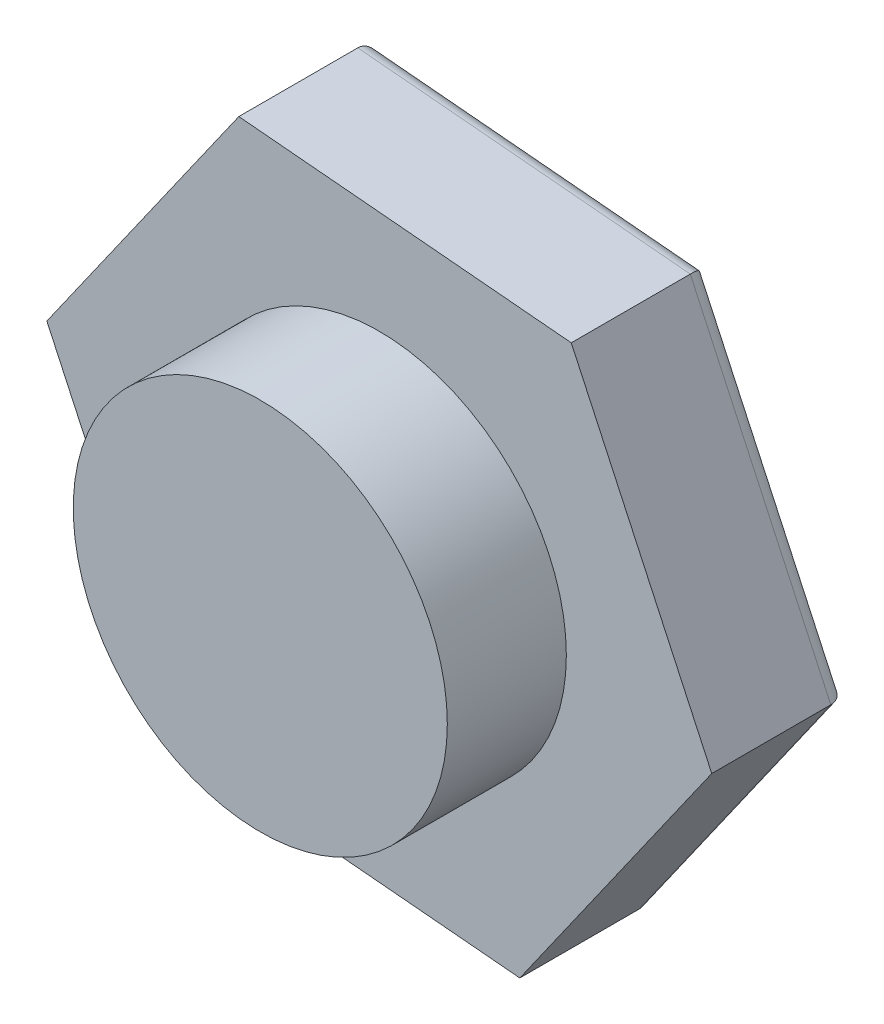
ISO-10303-21;
HEADER;
FILE_DESCRIPTION(('STEP AP214'),'2;1');
FILE_NAME('part.step','',(''),(''),'','','');
FILE_SCHEMA(('AUTOMOTIVE_DESIGN { 1 0 10303 214 1 1 1 1 }'));
ENDSEC;
DATA;
#1=APPLICATION_CONTEXT('core data for automotive mechanical design processes');
#2=APPLICATION_PROTOCOL_DEFINITION('international standard','automotive_design',2000,#1);
#3=PRODUCT_CONTEXT('',#1,'mechanical');
#4=PRODUCT('Part','Part','',(#3));
#5=PRODUCT_RELATED_PRODUCT_CATEGORY('part','',(#4));
#6=PRODUCT_DEFINITION_FORMATION('','',#4);
#7=PRODUCT_DEFINITION_CONTEXT('part definition',#1,'design');
#8=PRODUCT_DEFINITION('design','',#6,#7);
#9=PRODUCT_DEFINITION_SHAPE('','',#8);
#10=(LENGTH_UNIT() NAMED_UNIT(*) SI_UNIT(.MILLI.,.METRE.));
#11=(NAMED_UNIT(*) PLANE_ANGLE_UNIT() SI_UNIT($,.RADIAN.));
#12=(NAMED_UNIT(*) SI_UNIT($,.STERADIAN.) SOLID_ANGLE_UNIT());
#13=UNCERTAINTY_MEASURE_WITH_UNIT(LENGTH_MEASURE(1.E-05),#10,'distance_accuracy_value','');
#14=(GEOMETRIC_REPRESENTATION_CONTEXT(3) GLOBAL_UNCERTAINTY_ASSIGNED_CONTEXT((#13)) GLOBAL_UNIT_ASSIGNED_CONTEXT((#10,
#11,#12)) REPRESENTATION_CONTEXT('',''));
#15=CARTESIAN_POINT('',(0.,0.,0.));
#16=DIRECTION('',(0.,0.,1.));
#17=DIRECTION('',(1.,0.,0.));
#18=AXIS2_PLACEMENT_3D('',#15,#16,#17);
#19=CARTESIAN_POINT('',(0.,0.,7.));
#20=DIRECTION('',(0.,0.,-1.));
#21=DIRECTION('',(-1.,0.,0.));
#22=AXIS2_PLACEMENT_3D('',#19,#20,#21);
#23=CYLINDRICAL_SURFACE('',#22,11.);
#24=CARTESIAN_POINT('',(0.,0.,7.));
#25=DIRECTION('',(0.,0.,1.));
#26=DIRECTION('',(1.,0.,0.));
#27=AXIS2_PLACEMENT_3D('',#24,#25,#26);
#28=CIRCLE('',#27,11.);
#29=CARTESIAN_POINT('',(11.,0.,7.));
#30=VERTEX_POINT('',#29);
#31=EDGE_CURVE('E153',#30,#30,#28,.T.);
#32=ORIENTED_EDGE('',*,*,#31,.F.);
#33=EDGE_LOOP('',(#32));
#34=FACE_BOUND('',#33,.T.);
#35=CARTESIAN_POINT('',(0.,0.,0.));
#36=DIRECTION('',(0.,0.,1.));
#37=DIRECTION('',(1.,0.,0.));
#38=AXIS2_PLACEMENT_3D('',#35,#36,#37);
#39=CIRCLE('',#38,11.);
#40=CARTESIAN_POINT('',(11.,0.,0.));
#41=VERTEX_POINT('',#40);
#42=EDGE_CURVE('E116',#41,#41,#39,.T.);
#43=ORIENTED_EDGE('',*,*,#42,.T.);
#44=EDGE_LOOP('',(#43));
#45=FACE_BOUND('',#44,.T.);
#46=ADVANCED_FACE('F38',(#34,#45),#23,.T.);
#47=CARTESIAN_POINT('',(0.,0.,7.));
#48=DIRECTION('',(0.,0.,1.));
#49=DIRECTION('',(1.,0.,0.));
#50=AXIS2_PLACEMENT_3D('',#47,#48,#49);
#51=PLANE('',#50);
#52=ORIENTED_EDGE('',*,*,#31,.T.);
#53=EDGE_LOOP('',(#52));
#54=FACE_BOUND('',#53,.T.);
#55=ADVANCED_FACE('F234',(#54),#51,.T.);
#56=CARTESIAN_POINT('',(11.2892059741535,16.0588655205301,-8.));
#57=DIRECTION('',(-0.907093954646099,-0.420928209371267,0.));
#58=DIRECTION('',(0.420928209371267,-0.907093954646099,0.));
#59=AXIS2_PLACEMENT_3D('',#56,#57,#58);
#60=PLANE('',#59);
#61=DIRECTION('',(0.,0.,1.));
#62=VECTOR('',#61,1.);
#63=CARTESIAN_POINT('',(19.5519884838138,-1.74730640190698,-8.));
#64=LINE('',#63,#62);
#65=CARTESIAN_POINT('',(19.5519884838138,-1.74730640190698,-7.));
#66=VERTEX_POINT('',#65);
#67=CARTESIAN_POINT('',(19.5519884838138,-1.74730640190698,0.));
#68=VERTEX_POINT('',#67);
#69=EDGE_CURVE('E108',#66,#68,#64,.T.);
#70=ORIENTED_EDGE('',*,*,#69,.F.);
#71=DIRECTION('',(0.420928209371267,-0.907093954646099,0.));
#72=VECTOR('',#71,1.);
#73=CARTESIAN_POINT('',(11.2892059741535,16.0588655205301,-7.));
#74=LINE('',#73,#72);
#75=CARTESIAN_POINT('',(11.2892059741535,16.0588655205301,-7.));
#76=VERTEX_POINT('',#75);
#77=EDGE_CURVE('E11',#66,#76,#74,.F.);
#78=ORIENTED_EDGE('',*,*,#77,.T.);
#79=DIRECTION('',(0.,0.,1.));
#80=VECTOR('',#79,1.);
#81=CARTESIAN_POINT('',(11.2892059741535,16.0588655205301,-8.));
#82=LINE('',#81,#80);
#83=CARTESIAN_POINT('',(11.2892059741535,16.0588655205301,0.));
#84=VERTEX_POINT('',#83);
#85=EDGE_CURVE('E130',#76,#84,#82,.T.);
#86=ORIENTED_EDGE('',*,*,#85,.T.);
#87=DIRECTION('',(0.420928209371267,-0.907093954646099,0.));
#88=VECTOR('',#87,1.);
#89=CARTESIAN_POINT('',(11.2892059741535,16.0588655205301,0.));
#90=LINE('',#89,#88);
#91=EDGE_CURVE('E123',#84,#68,#90,.T.);
#92=ORIENTED_EDGE('',*,*,#91,.T.);
#93=EDGE_LOOP('',(#70,#78,#86,#92));
#94=FACE_BOUND('',#93,.T.);
#95=ADVANCED_FACE('F128',(#94),#60,.F.);
#96=CARTESIAN_POINT('',(19.5519884838138,-1.74730640190698,-8.));
#97=DIRECTION('',(-0.818081499808062,0.575102303657177,0.));
#98=DIRECTION('',(-0.575102303657177,-0.818081499808062,0.));
#99=AXIS2_PLACEMENT_3D('',#96,#97,#98);
#100=PLANE('',#99);
#101=DIRECTION('',(0.,0.,1.));
#102=VECTOR('',#101,1.);
#103=CARTESIAN_POINT('',(8.26278250966028,-17.8061719224371,-8.));
#104=LINE('',#103,#102);
#105=CARTESIAN_POINT('',(8.26278250966028,-17.8061719224371,-7.));
#106=VERTEX_POINT('',#105);
#107=CARTESIAN_POINT('',(8.26278250966028,-17.8061719224371,0.));
#108=VERTEX_POINT('',#107);
#109=EDGE_CURVE('E117',#106,#108,#104,.T.);
#110=ORIENTED_EDGE('',*,*,#109,.F.);
#111=DIRECTION('',(-0.575102303657177,-0.818081499808062,0.));
#112=VECTOR('',#111,1.);
#113=CARTESIAN_POINT('',(19.5519884838138,-1.74730640190698,-7.));
#114=LINE('',#113,#112);
#115=EDGE_CURVE('E47',#106,#66,#114,.F.);
#116=ORIENTED_EDGE('',*,*,#115,.T.);
#117=ORIENTED_EDGE('',*,*,#69,.T.);
#118=DIRECTION('',(-0.575102303657177,-0.818081499808062,0.));
#119=VECTOR('',#118,1.);
#120=CARTESIAN_POINT('',(19.5519884838138,-1.74730640190698,0.));
#121=LINE('',#120,#119);
#122=EDGE_CURVE('E111',#68,#108,#121,.T.);
#123=ORIENTED_EDGE('',*,*,#122,.T.);
#124=EDGE_LOOP('',(#110,#116,#117,#123));
#125=FACE_BOUND('',#124,.T.);
#126=ADVANCED_FACE('F110',(#125),#100,.F.);
#127=CARTESIAN_POINT('',(8.26278250966028,-17.8061719224371,-8.));
#128=DIRECTION('',(0.0890124548380372,0.996030513028445,0.));
#129=DIRECTION('',(-0.996030513028445,0.0890124548380372,0.));
#130=AXIS2_PLACEMENT_3D('',#127,#128,#129);
#131=PLANE('',#130);
#132=DIRECTION('',(0.,0.,1.));
#133=VECTOR('',#132,1.);
#134=CARTESIAN_POINT('',(-11.2892059741535,-16.0588655205301,-8.));
#135=LINE('',#134,#133);
#136=CARTESIAN_POINT('',(-11.2892059741535,-16.0588655205301,-7.));
#137=VERTEX_POINT('',#136);
#138=CARTESIAN_POINT('',(-11.2892059741535,-16.0588655205301,0.));
#139=VERTEX_POINT('',#138);
#140=EDGE_CURVE('E150',#137,#139,#135,.T.);
#141=ORIENTED_EDGE('',*,*,#140,.F.);
#142=DIRECTION('',(-0.996030513028445,0.0890124548380372,0.));
#143=VECTOR('',#142,1.);
#144=CARTESIAN_POINT('',(8.26278250966028,-17.8061719224371,-7.));
#145=LINE('',#144,#143);
#146=EDGE_CURVE('E62',#137,#106,#145,.F.);
#147=ORIENTED_EDGE('',*,*,#146,.T.);
#148=ORIENTED_EDGE('',*,*,#109,.T.);
#149=DIRECTION('',(-0.996030513028445,0.0890124548380372,0.));
#150=VECTOR('',#149,1.);
#151=CARTESIAN_POINT('',(8.26278250966028,-17.8061719224371,0.));
#152=LINE('',#151,#150);
#153=EDGE_CURVE('E126',#108,#139,#152,.T.);
#154=ORIENTED_EDGE('',*,*,#153,.T.);
#155=EDGE_LOOP('',(#141,#147,#148,#154));
#156=FACE_BOUND('',#155,.T.);
#157=ADVANCED_FACE('F321',(#156),#131,.F.);
#158=CARTESIAN_POINT('',(-11.2892059741535,-16.0588655205301,-8.));
#159=DIRECTION('',(0.907093954646099,0.420928209371267,0.));
#160=DIRECTION('',(-0.420928209371267,0.907093954646099,0.));
#161=AXIS2_PLACEMENT_3D('',#158,#159,#160);
#162=PLANE('',#161);
#163=DIRECTION('',(0.,0.,1.));
#164=VECTOR('',#163,1.);
#165=CARTESIAN_POINT('',(-19.5519884838138,1.74730640190698,-8.));
#166=LINE('',#165,#164);
#167=CARTESIAN_POINT('',(-19.5519884838138,1.74730640190698,-7.));
#168=VERTEX_POINT('',#167);
#169=CARTESIAN_POINT('',(-19.5519884838138,1.74730640190698,0.));
#170=VERTEX_POINT('',#169);
#171=EDGE_CURVE('E148',#168,#170,#166,.T.);
#172=ORIENTED_EDGE('',*,*,#171,.F.);
#173=DIRECTION('',(-0.420928209371267,0.907093954646099,0.));
#174=VECTOR('',#173,1.);
#175=CARTESIAN_POINT('',(-11.2892059741535,-16.0588655205301,-7.));
#176=LINE('',#175,#174);
#177=EDGE_CURVE('E176',#168,#137,#176,.F.);
#178=ORIENTED_EDGE('',*,*,#177,.T.);
#179=ORIENTED_EDGE('',*,*,#140,.T.);
#180=DIRECTION('',(-0.420928209371267,0.907093954646099,0.));
#181=VECTOR('',#180,1.);
#182=CARTESIAN_POINT('',(-11.2892059741535,-16.0588655205301,0.));
#183=LINE('',#182,#181);
#184=EDGE_CURVE('E137',#139,#170,#183,.T.);
#185=ORIENTED_EDGE('',*,*,#184,.T.);
#186=EDGE_LOOP('',(#172,#178,#179,#185));
#187=FACE_BOUND('',#186,.T.);
#188=ADVANCED_FACE('F223',(#187),#162,.F.);
#189=CARTESIAN_POINT('',(-19.5519884838138,1.74730640190698,-8.));
#190=DIRECTION('',(0.818081499808062,-0.575102303657177,0.));
#191=DIRECTION('',(0.575102303657177,0.818081499808062,0.));
#192=AXIS2_PLACEMENT_3D('',#189,#190,#191);
#193=PLANE('',#192);
#194=DIRECTION('',(0.,0.,1.));
#195=VECTOR('',#194,1.);
#196=CARTESIAN_POINT('',(-8.26278250966028,17.8061719224371,-8.));
#197=LINE('',#196,#195);
#198=CARTESIAN_POINT('',(-8.26278250966028,17.8061719224371,-7.));
#199=VERTEX_POINT('',#198);
#200=CARTESIAN_POINT('',(-8.26278250966028,17.8061719224371,0.));
#201=VERTEX_POINT('',#200);
#202=EDGE_CURVE('E146',#199,#201,#197,.T.);
#203=ORIENTED_EDGE('',*,*,#202,.F.);
#204=DIRECTION('',(0.575102303657177,0.818081499808062,0.));
#205=VECTOR('',#204,1.);
#206=CARTESIAN_POINT('',(-19.5519884838138,1.74730640190698,-7.));
#207=LINE('',#206,#205);
#208=EDGE_CURVE('E174',#199,#168,#207,.F.);
#209=ORIENTED_EDGE('',*,*,#208,.T.);
#210=ORIENTED_EDGE('',*,*,#171,.T.);
#211=DIRECTION('',(0.575102303657177,0.818081499808062,0.));
#212=VECTOR('',#211,1.);
#213=CARTESIAN_POINT('',(-19.5519884838138,1.74730640190698,0.));
#214=LINE('',#213,#212);
#215=EDGE_CURVE('E140',#170,#201,#214,.T.);
#216=ORIENTED_EDGE('',*,*,#215,.T.);
#217=EDGE_LOOP('',(#203,#209,#210,#216));
#218=FACE_BOUND('',#217,.T.);
#219=ADVANCED_FACE('F220',(#218),#193,.F.);
#220=CARTESIAN_POINT('',(-8.26278250966028,17.8061719224371,-8.));
#221=DIRECTION('',(-0.0890124548380371,-0.996030513028445,0.));
#222=DIRECTION('',(0.996030513028445,-0.0890124548380371,0.));
#223=AXIS2_PLACEMENT_3D('',#220,#221,#222);
#224=PLANE('',#223);
#225=ORIENTED_EDGE('',*,*,#85,.F.);
#226=DIRECTION('',(0.996030513028445,-0.0890124548380371,0.));
#227=VECTOR('',#226,1.);
#228=CARTESIAN_POINT('',(-8.26278250966028,17.8061719224371,-7.));
#229=LINE('',#228,#227);
#230=EDGE_CURVE('E171',#76,#199,#229,.F.);
#231=ORIENTED_EDGE('',*,*,#230,.T.);
#232=ORIENTED_EDGE('',*,*,#202,.T.);
#233=DIRECTION('',(0.996030513028445,-0.0890124548380371,0.));
#234=VECTOR('',#233,1.);
#235=CARTESIAN_POINT('',(-8.26278250966028,17.8061719224371,0.));
#236=LINE('',#235,#234);
#237=EDGE_CURVE('E143',#201,#84,#236,.T.);
#238=ORIENTED_EDGE('',*,*,#237,.T.);
#239=EDGE_LOOP('',(#225,#231,#232,#238));
#240=FACE_BOUND('',#239,.T.);
#241=ADVANCED_FACE('F209',(#240),#224,.F.);
#242=CARTESIAN_POINT('',(0.,0.,-8.));
#243=DIRECTION('',(0.,0.,-1.));
#244=DIRECTION('',(-1.,0.,0.));
#245=AXIS2_PLACEMENT_3D('',#242,#243,#244);
#246=PLANE('',#245);
#247=DIRECTION('',(0.575102303657177,0.818081499808062,0.));
#248=VECTOR('',#247,1.);
#249=CARTESIAN_POINT('',(-7.44470100985222,17.2310696187799,-8.));
#250=LINE('',#249,#248);
#251=CARTESIAN_POINT('',(-18.4018715141777,1.64452367238304,-8.));
#252=VERTEX_POINT('',#251);
#253=CARTESIAN_POINT('',(-7.77673647968026,16.7587500446466,-8.));
#254=VERTEX_POINT('',#253);
#255=EDGE_CURVE('E166',#252,#254,#250,.T.);
#256=ORIENTED_EDGE('',*,*,#255,.T.);
#257=DIRECTION('',(0.996030513028445,-0.0890124548380371,0.));
#258=VECTOR('',#257,1.);
#259=CARTESIAN_POINT('',(11.2001935193155,15.0628350075016,-8.));
#260=LINE('',#259,#258);
#261=CARTESIAN_POINT('',(10.6251350344974,15.1142263722636,-8.));
#262=VERTEX_POINT('',#261);
#263=EDGE_CURVE('E168',#254,#262,#260,.T.);
#264=ORIENTED_EDGE('',*,*,#263,.T.);
#265=DIRECTION('',(0.420928209371267,-0.907093954646099,0.));
#266=VECTOR('',#265,1.);
#267=CARTESIAN_POINT('',(18.6448945291677,-2.16823461127825,-8.));
#268=LINE('',#267,#266);
#269=CARTESIAN_POINT('',(18.4018715141777,-1.64452367238304,-8.));
#270=VERTEX_POINT('',#269);
#271=EDGE_CURVE('E156',#262,#270,#268,.T.);
#272=ORIENTED_EDGE('',*,*,#271,.T.);
#273=DIRECTION('',(-0.575102303657177,-0.818081499808062,0.));
#274=VECTOR('',#273,1.);
#275=CARTESIAN_POINT('',(7.44470100985222,-17.2310696187799,-8.));
#276=LINE('',#275,#274);
#277=CARTESIAN_POINT('',(7.77673647968026,-16.7587500446466,-8.));
#278=VERTEX_POINT('',#277);
#279=EDGE_CURVE('E160',#270,#278,#276,.T.);
#280=ORIENTED_EDGE('',*,*,#279,.T.);
#281=DIRECTION('',(-0.996030513028445,0.0890124548380372,0.));
#282=VECTOR('',#281,1.);
#283=CARTESIAN_POINT('',(-11.2001935193155,-15.0628350075016,-8.));
#284=LINE('',#283,#282);
#285=CARTESIAN_POINT('',(-10.6251350344975,-15.1142263722636,-8.));
#286=VERTEX_POINT('',#285);
#287=EDGE_CURVE('E162',#278,#286,#284,.T.);
#288=ORIENTED_EDGE('',*,*,#287,.T.);
#289=DIRECTION('',(-0.420928209371267,0.907093954646099,0.));
#290=VECTOR('',#289,1.);
#291=CARTESIAN_POINT('',(-18.6448945291677,2.16823461127825,-8.));
#292=LINE('',#291,#290);
#293=EDGE_CURVE('E164',#286,#252,#292,.T.);
#294=ORIENTED_EDGE('',*,*,#293,.T.);
#295=EDGE_LOOP('',(#256,#264,#272,#280,#288,#294));
#296=FACE_BOUND('',#295,.T.);
#297=ADVANCED_FACE('F199',(#296),#246,.T.);
#298=CARTESIAN_POINT('',(0.,0.,0.));
#299=DIRECTION('',(0.,0.,-1.));
#300=DIRECTION('',(-1.,0.,0.));
#301=AXIS2_PLACEMENT_3D('',#298,#299,#300);
#302=PLANE('',#301);
#303=ORIENTED_EDGE('',*,*,#42,.F.);
#304=EDGE_LOOP('',(#303));
#305=FACE_BOUND('',#304,.T.);
#306=ORIENTED_EDGE('',*,*,#91,.F.);
#307=ORIENTED_EDGE('',*,*,#237,.F.);
#308=ORIENTED_EDGE('',*,*,#215,.F.);
#309=ORIENTED_EDGE('',*,*,#184,.F.);
#310=ORIENTED_EDGE('',*,*,#153,.F.);
#311=ORIENTED_EDGE('',*,*,#122,.F.);
#312=EDGE_LOOP('',(#306,#307,#308,#309,#310,#311));
#313=FACE_BOUND('',#312,.T.);
#314=ADVANCED_FACE('F121',(#305,#313),#302,.F.);
#315=CARTESIAN_POINT('',(-1.4241992774086,-15.9364882084551,-7.));
#316=DIRECTION('',(0.996030513028445,-0.0890124548380372,0.));
#317=DIRECTION('',(0.0890124548380372,0.996030513028445,0.));
#318=AXIS2_PLACEMENT_3D('',#315,#316,#317);
#319=CYLINDRICAL_SURFACE('',#318,1.);
#320=CARTESIAN_POINT('',(7.77673647968026,-16.7587500446466,-7.));
#321=DIRECTION('',(0.907093954646099,0.420928209371267,0.));
#322=DIRECTION('',(-0.420928209371267,0.907093954646099,0.));
#323=AXIS2_PLACEMENT_3D('',#320,#321,#322);
#324=ELLIPSE('',#323,1.15470053837925,1.);
#325=EDGE_CURVE('E134',#106,#278,#324,.T.);
#326=ORIENTED_EDGE('',*,*,#325,.F.);
#327=ORIENTED_EDGE('',*,*,#146,.F.);
#328=CARTESIAN_POINT('',(-10.6251350344975,-15.1142263722636,-7.));
#329=DIRECTION('',(0.818081499808062,-0.575102303657178,0.));
#330=DIRECTION('',(0.575102303657178,0.818081499808062,0.));
#331=AXIS2_PLACEMENT_3D('',#328,#329,#330);
#332=ELLIPSE('',#331,1.15470053837925,1.);
#333=EDGE_CURVE('E42',#286,#137,#332,.F.);
#334=ORIENTED_EDGE('',*,*,#333,.F.);
#335=ORIENTED_EDGE('',*,*,#287,.F.);
#336=EDGE_LOOP('',(#326,#327,#334,#335));
#337=FACE_BOUND('',#336,.T.);
#338=ADVANCED_FACE('F40',(#337),#319,.T.);
#339=CARTESIAN_POINT('',(-14.5135032743376,-6.73485134994027,-7.));
#340=DIRECTION('',(0.420928209371267,-0.907093954646099,0.));
#341=DIRECTION('',(0.907093954646099,0.420928209371267,0.));
#342=AXIS2_PLACEMENT_3D('',#339,#340,#341);
#343=CYLINDRICAL_SURFACE('',#342,1.);
#344=ORIENTED_EDGE('',*,*,#333,.T.);
#345=ORIENTED_EDGE('',*,*,#177,.F.);
#346=CARTESIAN_POINT('',(-18.4018715141777,1.64452367238304,-7.));
#347=DIRECTION('',(-0.089012454838037,-0.996030513028445,0.));
#348=DIRECTION('',(0.996030513028445,-0.0890124548380371,0.));
#349=AXIS2_PLACEMENT_3D('',#346,#347,#348);
#350=ELLIPSE('',#349,1.15470053837925,1.);
#351=EDGE_CURVE('E187',#252,#168,#350,.F.);
#352=ORIENTED_EDGE('',*,*,#351,.F.);
#353=ORIENTED_EDGE('',*,*,#293,.F.);
#354=EDGE_LOOP('',(#344,#345,#352,#353));
#355=FACE_BOUND('',#354,.T.);
#356=ADVANCED_FACE('F226',(#355),#343,.T.);
#357=CARTESIAN_POINT('',(13.089303996929,-9.20163685851484,-7.));
#358=DIRECTION('',(0.575102303657177,0.818081499808062,0.));
#359=DIRECTION('',(-0.818081499808062,0.575102303657177,0.));
#360=AXIS2_PLACEMENT_3D('',#357,#358,#359);
#361=CYLINDRICAL_SURFACE('',#360,1.);
#362=ORIENTED_EDGE('',*,*,#325,.T.);
#363=ORIENTED_EDGE('',*,*,#279,.F.);
#364=CARTESIAN_POINT('',(18.4018715141777,-1.64452367238304,-7.));
#365=DIRECTION('',(0.0890124548380369,0.996030513028445,0.));
#366=DIRECTION('',(-0.996030513028445,0.089012454838037,0.));
#367=AXIS2_PLACEMENT_3D('',#364,#365,#366);
#368=ELLIPSE('',#367,1.15470053837925,1.);
#369=EDGE_CURVE('E184',#66,#270,#368,.T.);
#370=ORIENTED_EDGE('',*,*,#369,.F.);
#371=ORIENTED_EDGE('',*,*,#115,.F.);
#372=EDGE_LOOP('',(#362,#363,#370,#371));
#373=FACE_BOUND('',#372,.T.);
#374=ADVANCED_FACE('F193',(#373),#361,.T.);
#375=CARTESIAN_POINT('',(-13.089303996929,9.20163685851484,-7.));
#376=DIRECTION('',(-0.575102303657177,-0.818081499808062,0.));
#377=DIRECTION('',(0.818081499808062,-0.575102303657177,0.));
#378=AXIS2_PLACEMENT_3D('',#375,#376,#377);
#379=CYLINDRICAL_SURFACE('',#378,1.);
#380=ORIENTED_EDGE('',*,*,#351,.T.);
#381=ORIENTED_EDGE('',*,*,#208,.F.);
#382=CARTESIAN_POINT('',(-7.77673647968026,16.7587500446466,-7.));
#383=DIRECTION('',(-0.907093954646099,-0.420928209371267,0.));
#384=DIRECTION('',(0.420928209371267,-0.907093954646099,0.));
#385=AXIS2_PLACEMENT_3D('',#382,#383,#384);
#386=ELLIPSE('',#385,1.15470053837925,1.);
#387=EDGE_CURVE('E182',#254,#199,#386,.F.);
#388=ORIENTED_EDGE('',*,*,#387,.F.);
#389=ORIENTED_EDGE('',*,*,#255,.F.);
#390=EDGE_LOOP('',(#380,#381,#388,#389));
#391=FACE_BOUND('',#390,.T.);
#392=ADVANCED_FACE('F217',(#391),#379,.T.);
#393=CARTESIAN_POINT('',(14.5135032743376,6.73485134994028,-7.));
#394=DIRECTION('',(-0.420928209371267,0.907093954646099,0.));
#395=DIRECTION('',(-0.907093954646099,-0.420928209371267,0.));
#396=AXIS2_PLACEMENT_3D('',#393,#394,#395);
#397=CYLINDRICAL_SURFACE('',#396,1.);
#398=ORIENTED_EDGE('',*,*,#369,.T.);
#399=ORIENTED_EDGE('',*,*,#271,.F.);
#400=CARTESIAN_POINT('',(10.6251350344974,15.1142263722636,-7.));
#401=DIRECTION('',(-0.818081499808062,0.575102303657177,0.));
#402=DIRECTION('',(0.575102303657178,0.818081499808062,0.));
#403=AXIS2_PLACEMENT_3D('',#400,#401,#402);
#404=ELLIPSE('',#403,1.15470053837925,1.);
#405=EDGE_CURVE('E180',#76,#262,#404,.T.);
#406=ORIENTED_EDGE('',*,*,#405,.F.);
#407=ORIENTED_EDGE('',*,*,#77,.F.);
#408=EDGE_LOOP('',(#398,#399,#406,#407));
#409=FACE_BOUND('',#408,.T.);
#410=ADVANCED_FACE('F205',(#409),#397,.T.);
#411=CARTESIAN_POINT('',(1.42419927740859,15.9364882084551,-7.));
#412=DIRECTION('',(-0.996030513028445,0.0890124548380371,0.));
#413=DIRECTION('',(-0.0890124548380371,-0.996030513028445,0.));
#414=AXIS2_PLACEMENT_3D('',#411,#412,#413);
#415=CYLINDRICAL_SURFACE('',#414,1.);
#416=ORIENTED_EDGE('',*,*,#387,.T.);
#417=ORIENTED_EDGE('',*,*,#230,.F.);
#418=ORIENTED_EDGE('',*,*,#405,.T.);
#419=ORIENTED_EDGE('',*,*,#263,.F.);
#420=EDGE_LOOP('',(#416,#417,#418,#419));
#421=FACE_BOUND('',#420,.T.);
#422=ADVANCED_FACE('F212',(#421),#415,.T.);
#423=CLOSED_SHELL('',(#46,#55,#95,#126,#157,#188,#219,#241,#297,#314,#338,#356,#374,#392,#410,#422));
#424=MANIFOLD_SOLID_BREP('B2',#423);
#425=ADVANCED_BREP_SHAPE_REPRESENTATION('',(#18,#424),#14);
#426=SHAPE_DEFINITION_REPRESENTATION(#9,#425);
ENDSEC;
END-ISO-10303-21;
